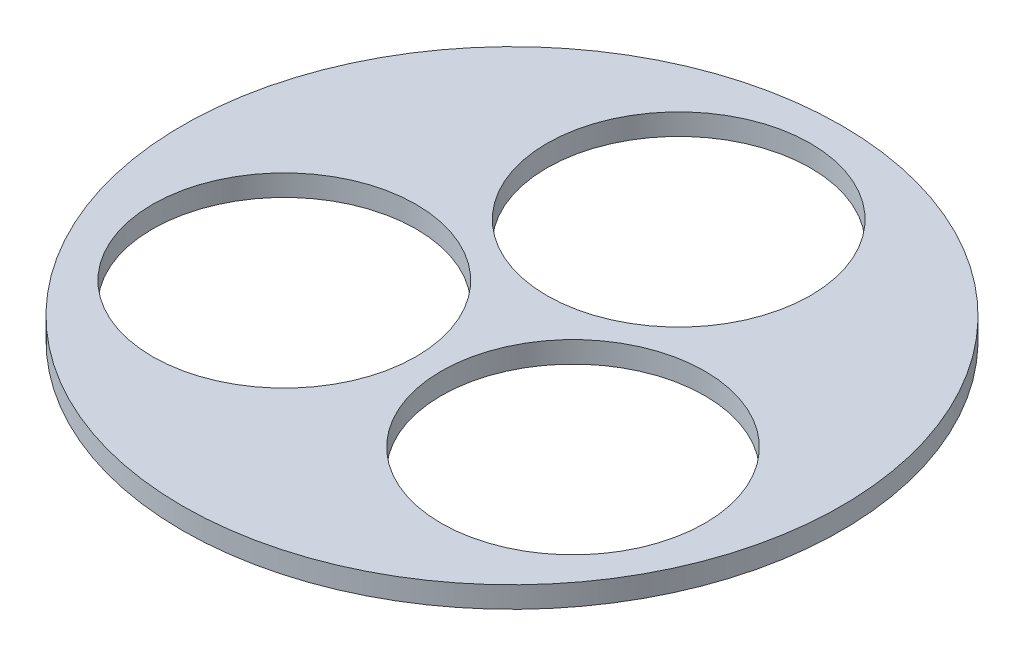
ISO-10303-21;
HEADER;
FILE_DESCRIPTION(('STEP AP214'),'2;1');
FILE_NAME('part.step','',(''),(''),'','','');
FILE_SCHEMA(('AUTOMOTIVE_DESIGN { 1 0 10303 214 1 1 1 1 }'));
ENDSEC;
DATA;
#1=APPLICATION_CONTEXT('core data for automotive mechanical design processes');
#2=APPLICATION_PROTOCOL_DEFINITION('international standard','automotive_design',2000,#1);
#3=PRODUCT_CONTEXT('',#1,'mechanical');
#4=PRODUCT('Part','Part','',(#3));
#5=PRODUCT_RELATED_PRODUCT_CATEGORY('part','',(#4));
#6=PRODUCT_DEFINITION_FORMATION('','',#4);
#7=PRODUCT_DEFINITION_CONTEXT('part definition',#1,'design');
#8=PRODUCT_DEFINITION('design','',#6,#7);
#9=PRODUCT_DEFINITION_SHAPE('','',#8);
#10=(LENGTH_UNIT() NAMED_UNIT(*) SI_UNIT(.MILLI.,.METRE.));
#11=(NAMED_UNIT(*) PLANE_ANGLE_UNIT() SI_UNIT($,.RADIAN.));
#12=(NAMED_UNIT(*) SI_UNIT($,.STERADIAN.) SOLID_ANGLE_UNIT());
#13=UNCERTAINTY_MEASURE_WITH_UNIT(LENGTH_MEASURE(1.E-05),#10,'distance_accuracy_value','');
#14=(GEOMETRIC_REPRESENTATION_CONTEXT(3) GLOBAL_UNCERTAINTY_ASSIGNED_CONTEXT((#13)) GLOBAL_UNIT_ASSIGNED_CONTEXT((#10,
#11,#12)) REPRESENTATION_CONTEXT('',''));
#15=CARTESIAN_POINT('',(0.,0.,0.));
#16=DIRECTION('',(0.,0.,1.));
#17=DIRECTION('',(1.,0.,0.));
#18=AXIS2_PLACEMENT_3D('',#15,#16,#17);
#19=CARTESIAN_POINT('',(0.,6.35,0.));
#20=DIRECTION('',(0.,1.,0.));
#21=DIRECTION('',(0.,0.,1.));
#22=AXIS2_PLACEMENT_3D('',#19,#20,#21);
#23=PLANE('',#22);
#24=CARTESIAN_POINT('',(43.1142087020045,6.35,24.892));
#25=DIRECTION('',(0.,1.,0.));
#26=DIRECTION('',(0.,0.,1.));
#27=AXIS2_PLACEMENT_3D('',#24,#25,#26);
#28=CIRCLE('',#27,39.37);
#29=CARTESIAN_POINT('',(43.1142087020045,6.35,64.2619999999999));
#30=VERTEX_POINT('',#29);
#31=EDGE_CURVE('E54',#30,#30,#28,.T.);
#32=ORIENTED_EDGE('',*,*,#31,.F.);
#33=EDGE_LOOP('',(#32));
#34=FACE_BOUND('',#33,.T.);
#35=CARTESIAN_POINT('',(0.,6.35,0.));
#36=DIRECTION('',(0.,1.,0.));
#37=DIRECTION('',(0.,0.,1.));
#38=AXIS2_PLACEMENT_3D('',#35,#36,#37);
#39=CIRCLE('',#38,98.425);
#40=CARTESIAN_POINT('',(0.,6.35,98.425));
#41=VERTEX_POINT('',#40);
#42=EDGE_CURVE('E10',#41,#41,#39,.T.);
#43=ORIENTED_EDGE('',*,*,#42,.T.);
#44=EDGE_LOOP('',(#43));
#45=FACE_BOUND('',#44,.T.);
#46=CARTESIAN_POINT('',(0.,6.35,-49.784));
#47=DIRECTION('',(0.,1.,0.));
#48=DIRECTION('',(0.,0.,1.));
#49=AXIS2_PLACEMENT_3D('',#46,#47,#48);
#50=CIRCLE('',#49,39.37);
#51=CARTESIAN_POINT('',(0.,6.35,-10.414));
#52=VERTEX_POINT('',#51);
#53=EDGE_CURVE('E49',#52,#52,#50,.T.);
#54=ORIENTED_EDGE('',*,*,#53,.F.);
#55=EDGE_LOOP('',(#54));
#56=FACE_BOUND('',#55,.T.);
#57=CARTESIAN_POINT('',(-43.1142087020045,6.35,24.892));
#58=DIRECTION('',(0.,1.,0.));
#59=DIRECTION('',(0.,0.,1.));
#60=AXIS2_PLACEMENT_3D('',#57,#58,#59);
#61=CIRCLE('',#60,39.37);
#62=CARTESIAN_POINT('',(-43.1142087020045,6.35,64.262));
#63=VERTEX_POINT('',#62);
#64=EDGE_CURVE('E60',#63,#63,#61,.T.);
#65=ORIENTED_EDGE('',*,*,#64,.F.);
#66=EDGE_LOOP('',(#65));
#67=FACE_BOUND('',#66,.T.);
#68=ADVANCED_FACE('F38',(#34,#45,#56,#67),#23,.T.);
#69=CARTESIAN_POINT('',(0.,0.,0.));
#70=DIRECTION('',(0.,1.,0.));
#71=DIRECTION('',(0.,0.,1.));
#72=AXIS2_PLACEMENT_3D('',#69,#70,#71);
#73=PLANE('',#72);
#74=CARTESIAN_POINT('',(0.,0.,0.));
#75=DIRECTION('',(0.,1.,0.));
#76=DIRECTION('',(0.,0.,1.));
#77=AXIS2_PLACEMENT_3D('',#74,#75,#76);
#78=CIRCLE('',#77,98.425);
#79=CARTESIAN_POINT('',(0.,0.,98.425));
#80=VERTEX_POINT('',#79);
#81=EDGE_CURVE('E42',#80,#80,#78,.T.);
#82=ORIENTED_EDGE('',*,*,#81,.F.);
#83=EDGE_LOOP('',(#82));
#84=FACE_BOUND('',#83,.T.);
#85=CARTESIAN_POINT('',(0.,0.,-49.784));
#86=DIRECTION('',(0.,1.,0.));
#87=DIRECTION('',(0.,0.,1.));
#88=AXIS2_PLACEMENT_3D('',#85,#86,#87);
#89=CIRCLE('',#88,39.37);
#90=CARTESIAN_POINT('',(0.,0.,-10.414));
#91=VERTEX_POINT('',#90);
#92=EDGE_CURVE('E51',#91,#91,#89,.T.);
#93=ORIENTED_EDGE('',*,*,#92,.T.);
#94=EDGE_LOOP('',(#93));
#95=FACE_BOUND('',#94,.T.);
#96=CARTESIAN_POINT('',(43.1142087020045,0.,24.892));
#97=DIRECTION('',(0.,1.,0.));
#98=DIRECTION('',(0.,0.,1.));
#99=AXIS2_PLACEMENT_3D('',#96,#97,#98);
#100=CIRCLE('',#99,39.37);
#101=CARTESIAN_POINT('',(43.1142087020045,0.,64.2619999999999));
#102=VERTEX_POINT('',#101);
#103=EDGE_CURVE('E57',#102,#102,#100,.T.);
#104=ORIENTED_EDGE('',*,*,#103,.T.);
#105=EDGE_LOOP('',(#104));
#106=FACE_BOUND('',#105,.T.);
#107=CARTESIAN_POINT('',(-43.1142087020045,0.,24.892));
#108=DIRECTION('',(0.,1.,0.));
#109=DIRECTION('',(0.,0.,1.));
#110=AXIS2_PLACEMENT_3D('',#107,#108,#109);
#111=CIRCLE('',#110,39.37);
#112=CARTESIAN_POINT('',(-43.1142087020045,0.,64.262));
#113=VERTEX_POINT('',#112);
#114=EDGE_CURVE('E63',#113,#113,#111,.T.);
#115=ORIENTED_EDGE('',*,*,#114,.T.);
#116=EDGE_LOOP('',(#115));
#117=FACE_BOUND('',#116,.T.);
#118=ADVANCED_FACE('F73',(#84,#95,#106,#117),#73,.F.);
#119=CARTESIAN_POINT('',(0.,6.35,0.));
#120=DIRECTION('',(0.,-1.,0.));
#121=DIRECTION('',(0.,0.,-1.));
#122=AXIS2_PLACEMENT_3D('',#119,#120,#121);
#123=CYLINDRICAL_SURFACE('',#122,98.425);
#124=ORIENTED_EDGE('',*,*,#42,.F.);
#125=EDGE_LOOP('',(#124));
#126=FACE_BOUND('',#125,.T.);
#127=ORIENTED_EDGE('',*,*,#81,.T.);
#128=EDGE_LOOP('',(#127));
#129=FACE_BOUND('',#128,.T.);
#130=ADVANCED_FACE('F40',(#126,#129),#123,.T.);
#131=CARTESIAN_POINT('',(0.,6.35,-49.784));
#132=DIRECTION('',(0.,-1.,0.));
#133=DIRECTION('',(0.,0.,-1.));
#134=AXIS2_PLACEMENT_3D('',#131,#132,#133);
#135=CYLINDRICAL_SURFACE('',#134,39.37);
#136=ORIENTED_EDGE('',*,*,#53,.T.);
#137=EDGE_LOOP('',(#136));
#138=FACE_BOUND('',#137,.T.);
#139=ORIENTED_EDGE('',*,*,#92,.F.);
#140=EDGE_LOOP('',(#139));
#141=FACE_BOUND('',#140,.T.);
#142=ADVANCED_FACE('F82',(#138,#141),#135,.F.);
#143=CARTESIAN_POINT('',(43.1142087020045,6.35,24.892));
#144=DIRECTION('',(0.,-1.,0.));
#145=DIRECTION('',(0.,0.,-1.));
#146=AXIS2_PLACEMENT_3D('',#143,#144,#145);
#147=CYLINDRICAL_SURFACE('',#146,39.37);
#148=ORIENTED_EDGE('',*,*,#31,.T.);
#149=EDGE_LOOP('',(#148));
#150=FACE_BOUND('',#149,.T.);
#151=ORIENTED_EDGE('',*,*,#103,.F.);
#152=EDGE_LOOP('',(#151));
#153=FACE_BOUND('',#152,.T.);
#154=ADVANCED_FACE('F85',(#150,#153),#147,.F.);
#155=CARTESIAN_POINT('',(-43.1142087020045,6.35,24.892));
#156=DIRECTION('',(0.,-1.,0.));
#157=DIRECTION('',(0.,0.,-1.));
#158=AXIS2_PLACEMENT_3D('',#155,#156,#157);
#159=CYLINDRICAL_SURFACE('',#158,39.37);
#160=ORIENTED_EDGE('',*,*,#64,.T.);
#161=EDGE_LOOP('',(#160));
#162=FACE_BOUND('',#161,.T.);
#163=ORIENTED_EDGE('',*,*,#114,.F.);
#164=EDGE_LOOP('',(#163));
#165=FACE_BOUND('',#164,.T.);
#166=ADVANCED_FACE('F69',(#162,#165),#159,.F.);
#167=CLOSED_SHELL('',(#68,#118,#130,#142,#154,#166));
#168=MANIFOLD_SOLID_BREP('B2',#167);
#169=ADVANCED_BREP_SHAPE_REPRESENTATION('',(#18,#168),#14);
#170=SHAPE_DEFINITION_REPRESENTATION(#9,#169);
ENDSEC;
END-ISO-10303-21;
